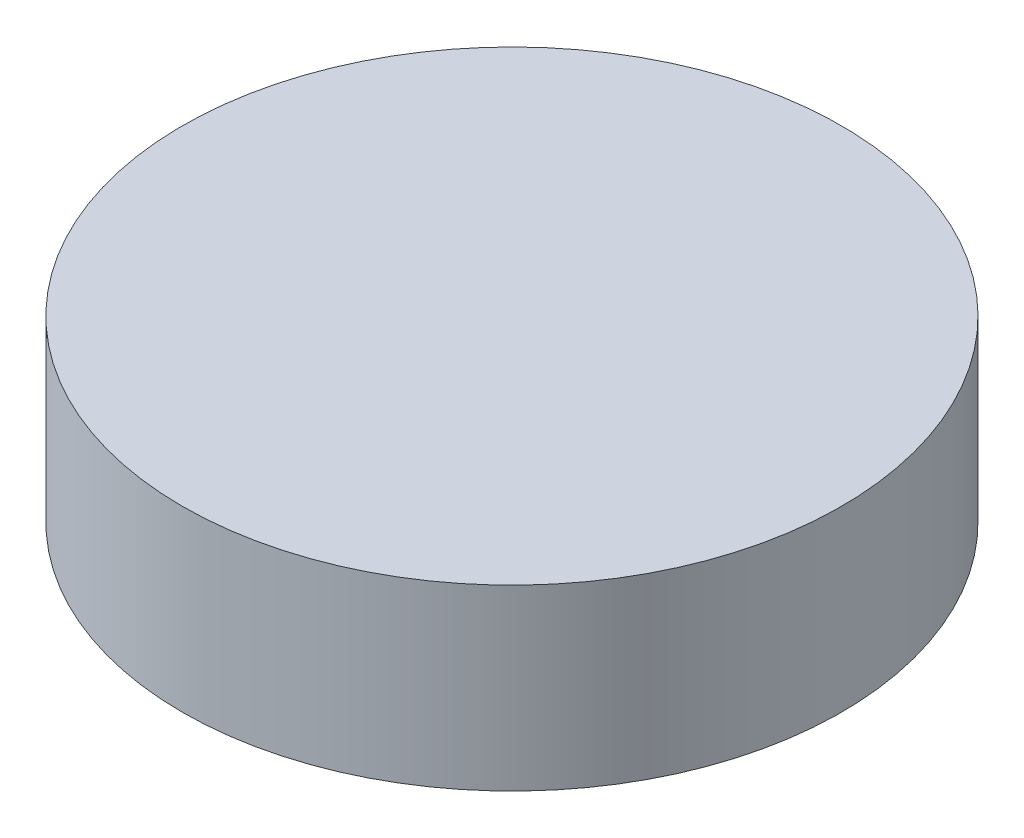
ISO-10303-21;
HEADER;
FILE_DESCRIPTION(('STEP AP214'),'2;1');
FILE_NAME('part.step','',(''),(''),'','','');
FILE_SCHEMA(('AUTOMOTIVE_DESIGN { 1 0 10303 214 1 1 1 1 }'));
ENDSEC;
DATA;
#1=APPLICATION_CONTEXT('core data for automotive mechanical design processes');
#2=APPLICATION_PROTOCOL_DEFINITION('international standard','automotive_design',2000,#1);
#3=PRODUCT_CONTEXT('',#1,'mechanical');
#4=PRODUCT('Part','Part','',(#3));
#5=PRODUCT_RELATED_PRODUCT_CATEGORY('part','',(#4));
#6=PRODUCT_DEFINITION_FORMATION('','',#4);
#7=PRODUCT_DEFINITION_CONTEXT('part definition',#1,'design');
#8=PRODUCT_DEFINITION('design','',#6,#7);
#9=PRODUCT_DEFINITION_SHAPE('','',#8);
#10=(LENGTH_UNIT() NAMED_UNIT(*) SI_UNIT(.MILLI.,.METRE.));
#11=(NAMED_UNIT(*) PLANE_ANGLE_UNIT() SI_UNIT($,.RADIAN.));
#12=(NAMED_UNIT(*) SI_UNIT($,.STERADIAN.) SOLID_ANGLE_UNIT());
#13=UNCERTAINTY_MEASURE_WITH_UNIT(LENGTH_MEASURE(1.E-05),#10,'distance_accuracy_value','');
#14=(GEOMETRIC_REPRESENTATION_CONTEXT(3) GLOBAL_UNCERTAINTY_ASSIGNED_CONTEXT((#13)) GLOBAL_UNIT_ASSIGNED_CONTEXT((#10,
#11,#12)) REPRESENTATION_CONTEXT('',''));
#15=CARTESIAN_POINT('',(0.,0.,0.));
#16=DIRECTION('',(0.,0.,1.));
#17=DIRECTION('',(1.,0.,0.));
#18=AXIS2_PLACEMENT_3D('',#15,#16,#17);
#19=CARTESIAN_POINT('',(0.,92.,0.));
#20=DIRECTION('',(0.,-1.,0.));
#21=DIRECTION('',(0.,0.,-1.));
#22=AXIS2_PLACEMENT_3D('',#19,#20,#21);
#23=CYLINDRICAL_SURFACE('',#22,170.);
#24=CARTESIAN_POINT('',(0.,92.,0.));
#25=DIRECTION('',(0.,1.,0.));
#26=DIRECTION('',(0.,0.,1.));
#27=AXIS2_PLACEMENT_3D('',#24,#25,#26);
#28=CIRCLE('',#27,170.);
#29=CARTESIAN_POINT('',(0.,92.,170.));
#30=VERTEX_POINT('',#29);
#31=EDGE_CURVE('E10',#30,#30,#28,.T.);
#32=ORIENTED_EDGE('',*,*,#31,.F.);
#33=EDGE_LOOP('',(#32));
#34=FACE_BOUND('',#33,.T.);
#35=CARTESIAN_POINT('',(0.,0.,0.));
#36=DIRECTION('',(0.,1.,0.));
#37=DIRECTION('',(0.,0.,1.));
#38=AXIS2_PLACEMENT_3D('',#35,#36,#37);
#39=CIRCLE('',#38,170.);
#40=CARTESIAN_POINT('',(0.,0.,170.));
#41=VERTEX_POINT('',#40);
#42=EDGE_CURVE('E34',#41,#41,#39,.T.);
#43=ORIENTED_EDGE('',*,*,#42,.T.);
#44=EDGE_LOOP('',(#43));
#45=FACE_BOUND('',#44,.T.);
#46=ADVANCED_FACE('F31',(#34,#45),#23,.T.);
#47=CARTESIAN_POINT('',(0.,92.,0.));
#48=DIRECTION('',(0.,1.,0.));
#49=DIRECTION('',(0.,0.,1.));
#50=AXIS2_PLACEMENT_3D('',#47,#48,#49);
#51=PLANE('',#50);
#52=ORIENTED_EDGE('',*,*,#31,.T.);
#53=EDGE_LOOP('',(#52));
#54=FACE_BOUND('',#53,.T.);
#55=ADVANCED_FACE('F46',(#54),#51,.T.);
#56=CARTESIAN_POINT('',(0.,0.,0.));
#57=DIRECTION('',(0.,1.,0.));
#58=DIRECTION('',(0.,0.,1.));
#59=AXIS2_PLACEMENT_3D('',#56,#57,#58);
#60=PLANE('',#59);
#61=ORIENTED_EDGE('',*,*,#42,.F.);
#62=EDGE_LOOP('',(#61));
#63=FACE_BOUND('',#62,.T.);
#64=ADVANCED_FACE('F44',(#63),#60,.F.);
#65=CLOSED_SHELL('',(#46,#55,#64));
#66=MANIFOLD_SOLID_BREP('B2',#65);
#67=ADVANCED_BREP_SHAPE_REPRESENTATION('',(#18,#66),#14);
#68=SHAPE_DEFINITION_REPRESENTATION(#9,#67);
ENDSEC;
END-ISO-10303-21;
